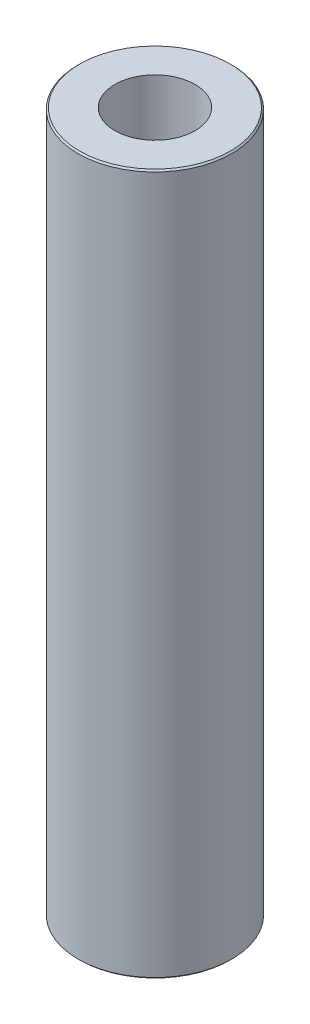
ISO-10303-21;
HEADER;
FILE_DESCRIPTION(('STEP AP214'),'2;1');
FILE_NAME('part.step','',(''),(''),'','','');
FILE_SCHEMA(('AUTOMOTIVE_DESIGN { 1 0 10303 214 1 1 1 1 }'));
ENDSEC;
DATA;
#1=APPLICATION_CONTEXT('core data for automotive mechanical design processes');
#2=APPLICATION_PROTOCOL_DEFINITION('international standard','automotive_design',2000,#1);
#3=PRODUCT_CONTEXT('',#1,'mechanical');
#4=PRODUCT('Part','Part','',(#3));
#5=PRODUCT_RELATED_PRODUCT_CATEGORY('part','',(#4));
#6=PRODUCT_DEFINITION_FORMATION('','',#4);
#7=PRODUCT_DEFINITION_CONTEXT('part definition',#1,'design');
#8=PRODUCT_DEFINITION('design','',#6,#7);
#9=PRODUCT_DEFINITION_SHAPE('','',#8);
#10=(LENGTH_UNIT() NAMED_UNIT(*) SI_UNIT(.MILLI.,.METRE.));
#11=(NAMED_UNIT(*) PLANE_ANGLE_UNIT() SI_UNIT($,.RADIAN.));
#12=(NAMED_UNIT(*) SI_UNIT($,.STERADIAN.) SOLID_ANGLE_UNIT());
#13=UNCERTAINTY_MEASURE_WITH_UNIT(LENGTH_MEASURE(1.E-05),#10,'distance_accuracy_value','');
#14=(GEOMETRIC_REPRESENTATION_CONTEXT(3) GLOBAL_UNCERTAINTY_ASSIGNED_CONTEXT((#13)) GLOBAL_UNIT_ASSIGNED_CONTEXT((#10,
#11,#12)) REPRESENTATION_CONTEXT('',''));
#15=CARTESIAN_POINT('',(0.,0.,0.));
#16=DIRECTION('',(0.,0.,1.));
#17=DIRECTION('',(1.,0.,0.));
#18=AXIS2_PLACEMENT_3D('',#15,#16,#17);
#19=CARTESIAN_POINT('',(0.,478.452020077667,0.));
#20=DIRECTION('',(0.,-1.,0.));
#21=DIRECTION('',(0.,0.,-1.));
#22=AXIS2_PLACEMENT_3D('',#19,#20,#21);
#23=CYLINDRICAL_SURFACE('',#22,52.5);
#24=CARTESIAN_POINT('',(0.,477.440428927924,0.));
#25=DIRECTION('',(0.,1.,0.));
#26=DIRECTION('',(0.,0.,1.));
#27=AXIS2_PLACEMENT_3D('',#24,#25,#26);
#28=CIRCLE('',#27,52.5);
#29=CARTESIAN_POINT('',(0.,477.440428927924,52.5));
#30=VERTEX_POINT('',#29);
#31=EDGE_CURVE('E50',#30,#30,#28,.F.);
#32=ORIENTED_EDGE('',*,*,#31,.T.);
#33=EDGE_LOOP('',(#32));
#34=FACE_BOUND('',#33,.T.);
#35=CARTESIAN_POINT('',(0.,1.0115911497432,0.));
#36=DIRECTION('',(0.,1.,0.));
#37=DIRECTION('',(0.,0.,1.));
#38=AXIS2_PLACEMENT_3D('',#35,#36,#37);
#39=CIRCLE('',#38,52.5);
#40=CARTESIAN_POINT('',(0.,1.0115911497432,52.5));
#41=VERTEX_POINT('',#40);
#42=EDGE_CURVE('E51',#41,#41,#39,.T.);
#43=ORIENTED_EDGE('',*,*,#42,.T.);
#44=EDGE_LOOP('',(#43));
#45=FACE_BOUND('',#44,.T.);
#46=ADVANCED_FACE('F39',(#34,#45),#23,.T.);
#47=CARTESIAN_POINT('',(0.,478.452020077667,0.));
#48=DIRECTION('',(0.,1.,0.));
#49=DIRECTION('',(0.,0.,1.));
#50=AXIS2_PLACEMENT_3D('',#47,#48,#49);
#51=PLANE('',#50);
#52=CARTESIAN_POINT('',(0.,478.452020077667,0.));
#53=DIRECTION('',(0.,1.,0.));
#54=DIRECTION('',(0.,0.,1.));
#55=AXIS2_PLACEMENT_3D('',#52,#53,#54);
#56=CIRCLE('',#55,51.4884088502568);
#57=CARTESIAN_POINT('',(0.,478.452020077667,51.4884088502568));
#58=VERTEX_POINT('',#57);
#59=EDGE_CURVE('E54',#58,#58,#56,.T.);
#60=ORIENTED_EDGE('',*,*,#59,.T.);
#61=EDGE_LOOP('',(#60));
#62=FACE_BOUND('',#61,.T.);
#63=CARTESIAN_POINT('',(0.,478.452020077667,0.));
#64=DIRECTION('',(0.,1.,0.));
#65=DIRECTION('',(0.,0.,1.));
#66=AXIS2_PLACEMENT_3D('',#63,#64,#65);
#67=CIRCLE('',#66,27.3941823155736);
#68=CARTESIAN_POINT('',(0.,478.452020077667,27.3941823155736));
#69=VERTEX_POINT('',#68);
#70=EDGE_CURVE('E58',#69,#69,#67,.T.);
#71=ORIENTED_EDGE('',*,*,#70,.F.);
#72=EDGE_LOOP('',(#71));
#73=FACE_BOUND('',#72,.T.);
#74=ADVANCED_FACE('F69',(#62,#73),#51,.T.);
#75=CARTESIAN_POINT('',(0.,0.,0.));
#76=DIRECTION('',(0.,1.,0.));
#77=DIRECTION('',(0.,0.,1.));
#78=AXIS2_PLACEMENT_3D('',#75,#76,#77);
#79=PLANE('',#78);
#80=CARTESIAN_POINT('',(0.,0.,0.));
#81=DIRECTION('',(0.,1.,0.));
#82=DIRECTION('',(0.,0.,1.));
#83=AXIS2_PLACEMENT_3D('',#80,#81,#82);
#84=CIRCLE('',#83,51.4884088502569);
#85=CARTESIAN_POINT('',(0.,0.,51.4884088502569));
#86=VERTEX_POINT('',#85);
#87=EDGE_CURVE('E10',#86,#86,#84,.F.);
#88=ORIENTED_EDGE('',*,*,#87,.T.);
#89=EDGE_LOOP('',(#88));
#90=FACE_BOUND('',#89,.T.);
#91=CARTESIAN_POINT('',(0.,0.,0.));
#92=DIRECTION('',(0.,1.,0.));
#93=DIRECTION('',(0.,0.,1.));
#94=AXIS2_PLACEMENT_3D('',#91,#92,#93);
#95=CIRCLE('',#94,27.3941823155736);
#96=CARTESIAN_POINT('',(0.,0.,27.3941823155736));
#97=VERTEX_POINT('',#96);
#98=EDGE_CURVE('E63',#97,#97,#95,.T.);
#99=ORIENTED_EDGE('',*,*,#98,.T.);
#100=EDGE_LOOP('',(#99));
#101=FACE_BOUND('',#100,.T.);
#102=ADVANCED_FACE('F75',(#90,#101),#79,.F.);
#103=CARTESIAN_POINT('',(0.,478.452020077667,0.));
#104=DIRECTION('',(0.,-1.,0.));
#105=DIRECTION('',(0.,0.,-1.));
#106=AXIS2_PLACEMENT_3D('',#103,#104,#105);
#107=CYLINDRICAL_SURFACE('',#106,27.3941823155736);
#108=ORIENTED_EDGE('',*,*,#70,.T.);
#109=EDGE_LOOP('',(#108));
#110=FACE_BOUND('',#109,.T.);
#111=ORIENTED_EDGE('',*,*,#98,.F.);
#112=EDGE_LOOP('',(#111));
#113=FACE_BOUND('',#112,.T.);
#114=ADVANCED_FACE('F70',(#110,#113),#107,.F.);
#115=CARTESIAN_POINT('',(0.,478.452020077667,0.));
#116=DIRECTION('',(0.,-1.,0.));
#117=DIRECTION('',(0.,0.,-1.));
#118=AXIS2_PLACEMENT_3D('',#115,#116,#117);
#119=CONICAL_SURFACE('',#118,51.4884088502568,0.785398163397424);
#120=ORIENTED_EDGE('',*,*,#31,.F.);
#121=EDGE_LOOP('',(#120));
#122=FACE_BOUND('',#121,.T.);
#123=ORIENTED_EDGE('',*,*,#59,.F.);
#124=EDGE_LOOP('',(#123));
#125=FACE_BOUND('',#124,.T.);
#126=ADVANCED_FACE('F81',(#122,#125),#119,.T.);
#127=CARTESIAN_POINT('',(0.,1.0115911497432,0.));
#128=DIRECTION('',(0.,1.,0.));
#129=DIRECTION('',(0.,0.,1.));
#130=AXIS2_PLACEMENT_3D('',#127,#128,#129);
#131=CONICAL_SURFACE('',#130,52.5,0.785398163397424);
#132=ORIENTED_EDGE('',*,*,#87,.F.);
#133=EDGE_LOOP('',(#132));
#134=FACE_BOUND('',#133,.T.);
#135=ORIENTED_EDGE('',*,*,#42,.F.);
#136=EDGE_LOOP('',(#135));
#137=FACE_BOUND('',#136,.T.);
#138=ADVANCED_FACE('F45',(#134,#137),#131,.T.);
#139=CLOSED_SHELL('',(#46,#74,#102,#114,#126,#138));
#140=MANIFOLD_SOLID_BREP('B2',#139);
#141=ADVANCED_BREP_SHAPE_REPRESENTATION('',(#18,#140),#14);
#142=SHAPE_DEFINITION_REPRESENTATION(#9,#141);
ENDSEC;
END-ISO-10303-21;
